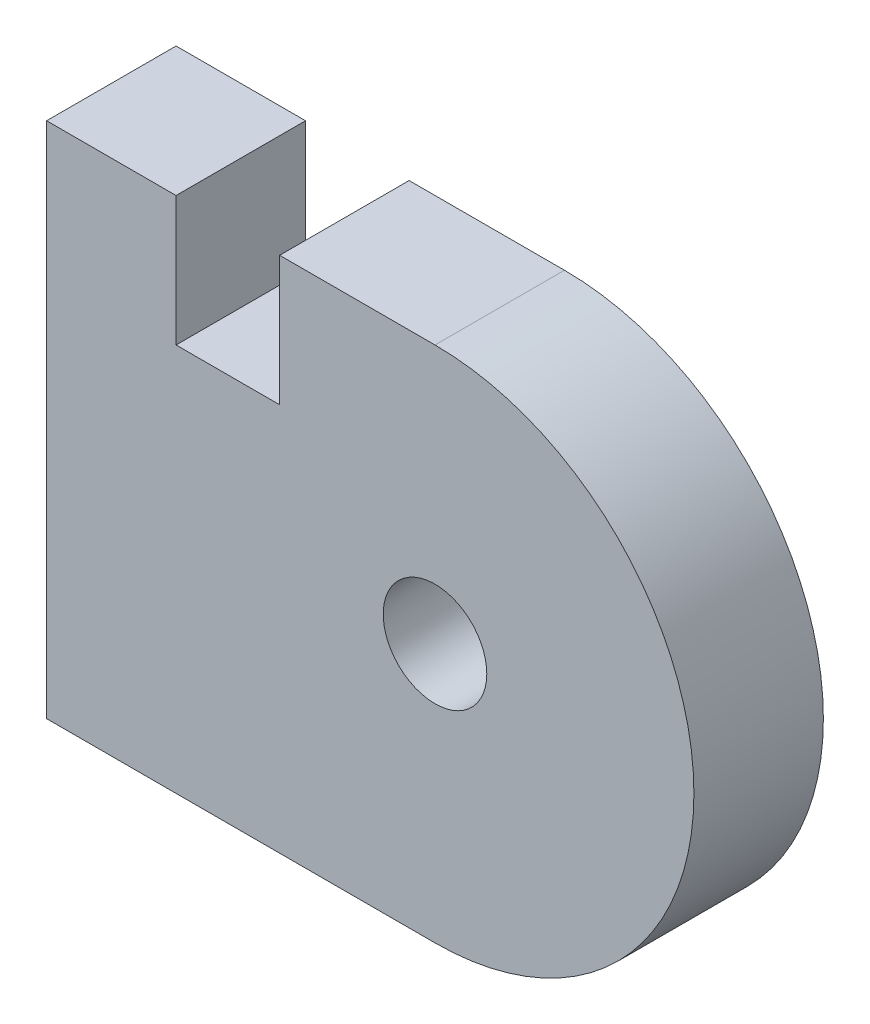
ISO-10303-21;
HEADER;
FILE_DESCRIPTION(('STEP AP214'),'2;1');
FILE_NAME('part.step','',(''),(''),'','','');
FILE_SCHEMA(('AUTOMOTIVE_DESIGN { 1 0 10303 214 1 1 1 1 }'));
ENDSEC;
DATA;
#1=APPLICATION_CONTEXT('core data for automotive mechanical design processes');
#2=APPLICATION_PROTOCOL_DEFINITION('international standard','automotive_design',2000,#1);
#3=PRODUCT_CONTEXT('',#1,'mechanical');
#4=PRODUCT('Part','Part','',(#3));
#5=PRODUCT_RELATED_PRODUCT_CATEGORY('part','',(#4));
#6=PRODUCT_DEFINITION_FORMATION('','',#4);
#7=PRODUCT_DEFINITION_CONTEXT('part definition',#1,'design');
#8=PRODUCT_DEFINITION('design','',#6,#7);
#9=PRODUCT_DEFINITION_SHAPE('','',#8);
#10=(LENGTH_UNIT() NAMED_UNIT(*) SI_UNIT(.MILLI.,.METRE.));
#11=(NAMED_UNIT(*) PLANE_ANGLE_UNIT() SI_UNIT($,.RADIAN.));
#12=(NAMED_UNIT(*) SI_UNIT($,.STERADIAN.) SOLID_ANGLE_UNIT());
#13=UNCERTAINTY_MEASURE_WITH_UNIT(LENGTH_MEASURE(1.E-05),#10,'distance_accuracy_value','');
#14=(GEOMETRIC_REPRESENTATION_CONTEXT(3) GLOBAL_UNCERTAINTY_ASSIGNED_CONTEXT((#13)) GLOBAL_UNIT_ASSIGNED_CONTEXT((#10,
#11,#12)) REPRESENTATION_CONTEXT('',''));
#15=CARTESIAN_POINT('',(0.,0.,0.));
#16=DIRECTION('',(0.,0.,1.));
#17=DIRECTION('',(1.,0.,0.));
#18=AXIS2_PLACEMENT_3D('',#15,#16,#17);
#19=CARTESIAN_POINT('',(2.5,0.,5.));
#20=DIRECTION('',(0.,0.,1.));
#21=DIRECTION('',(1.,0.,0.));
#22=AXIS2_PLACEMENT_3D('',#19,#20,#21);
#23=PLANE('',#22);
#24=CARTESIAN_POINT('',(2.5,0.,5.));
#25=DIRECTION('',(0.,0.,1.));
#26=DIRECTION('',(1.,0.,0.));
#27=AXIS2_PLACEMENT_3D('',#24,#25,#26);
#28=CIRCLE('',#27,10.);
#29=CARTESIAN_POINT('',(2.50000000000011,-10.,5.));
#30=VERTEX_POINT('',#29);
#31=CARTESIAN_POINT('',(2.5,10.,5.));
#32=VERTEX_POINT('',#31);
#33=EDGE_CURVE('E144',#30,#32,#28,.T.);
#34=ORIENTED_EDGE('',*,*,#33,.T.);
#35=DIRECTION('',(-1.,0.,0.));
#36=VECTOR('',#35,1.);
#37=CARTESIAN_POINT('',(-3.5,10.,5.));
#38=LINE('',#37,#36);
#39=CARTESIAN_POINT('',(-3.5,10.,5.));
#40=VERTEX_POINT('',#39);
#41=EDGE_CURVE('E91',#32,#40,#38,.T.);
#42=ORIENTED_EDGE('',*,*,#41,.T.);
#43=DIRECTION('',(0.,-1.,0.));
#44=VECTOR('',#43,1.);
#45=CARTESIAN_POINT('',(-3.5,10.,5.));
#46=LINE('',#45,#44);
#47=CARTESIAN_POINT('',(-3.5,5.,5.));
#48=VERTEX_POINT('',#47);
#49=EDGE_CURVE('E159',#40,#48,#46,.T.);
#50=ORIENTED_EDGE('',*,*,#49,.T.);
#51=DIRECTION('',(-1.,0.,0.));
#52=VECTOR('',#51,1.);
#53=CARTESIAN_POINT('',(-3.5,5.,5.));
#54=LINE('',#53,#52);
#55=CARTESIAN_POINT('',(-7.5,5.,5.));
#56=VERTEX_POINT('',#55);
#57=EDGE_CURVE('E172',#48,#56,#54,.T.);
#58=ORIENTED_EDGE('',*,*,#57,.T.);
#59=DIRECTION('',(0.,1.,0.));
#60=VECTOR('',#59,1.);
#61=CARTESIAN_POINT('',(-7.5,5.,5.));
#62=LINE('',#61,#60);
#63=CARTESIAN_POINT('',(-7.5,10.,5.));
#64=VERTEX_POINT('',#63);
#65=EDGE_CURVE('E110',#56,#64,#62,.T.);
#66=ORIENTED_EDGE('',*,*,#65,.T.);
#67=DIRECTION('',(-1.,0.,0.));
#68=VECTOR('',#67,1.);
#69=CARTESIAN_POINT('',(-7.5,10.,5.));
#70=LINE('',#69,#68);
#71=CARTESIAN_POINT('',(-12.5,10.,5.));
#72=VERTEX_POINT('',#71);
#73=EDGE_CURVE('E104',#64,#72,#70,.T.);
#74=ORIENTED_EDGE('',*,*,#73,.T.);
#75=DIRECTION('',(0.,-1.,0.));
#76=VECTOR('',#75,1.);
#77=CARTESIAN_POINT('',(-12.5,5.,5.));
#78=LINE('',#77,#76);
#79=CARTESIAN_POINT('',(-12.5,-10.,5.));
#80=VERTEX_POINT('',#79);
#81=EDGE_CURVE('E108',#72,#80,#78,.T.);
#82=ORIENTED_EDGE('',*,*,#81,.T.);
#83=DIRECTION('',(1.,0.,0.));
#84=VECTOR('',#83,1.);
#85=CARTESIAN_POINT('',(-12.5,-10.,5.));
#86=LINE('',#85,#84);
#87=EDGE_CURVE('E49',#80,#30,#86,.T.);
#88=ORIENTED_EDGE('',*,*,#87,.T.);
#89=EDGE_LOOP('',(#34,#42,#50,#58,#66,#74,#82,#88));
#90=FACE_BOUND('',#89,.T.);
#91=CARTESIAN_POINT('',(2.5,0.,5.));
#92=DIRECTION('',(0.,0.,1.));
#93=DIRECTION('',(1.,0.,0.));
#94=AXIS2_PLACEMENT_3D('',#91,#92,#93);
#95=CIRCLE('',#94,2.);
#96=CARTESIAN_POINT('',(4.5,0.,5.));
#97=VERTEX_POINT('',#96);
#98=EDGE_CURVE('E133',#97,#97,#95,.T.);
#99=ORIENTED_EDGE('',*,*,#98,.F.);
#100=EDGE_LOOP('',(#99));
#101=FACE_BOUND('',#100,.T.);
#102=ADVANCED_FACE('F32',(#90,#101),#23,.T.);
#103=CARTESIAN_POINT('',(2.5,0.,0.));
#104=DIRECTION('',(0.,0.,1.));
#105=DIRECTION('',(1.,0.,0.));
#106=AXIS2_PLACEMENT_3D('',#103,#104,#105);
#107=PLANE('',#106);
#108=CARTESIAN_POINT('',(2.5,0.,0.));
#109=DIRECTION('',(0.,0.,1.));
#110=DIRECTION('',(1.,0.,0.));
#111=AXIS2_PLACEMENT_3D('',#108,#109,#110);
#112=CIRCLE('',#111,10.);
#113=CARTESIAN_POINT('',(2.50000000000011,-10.,0.));
#114=VERTEX_POINT('',#113);
#115=CARTESIAN_POINT('',(2.5,10.,0.));
#116=VERTEX_POINT('',#115);
#117=EDGE_CURVE('E129',#114,#116,#112,.T.);
#118=ORIENTED_EDGE('',*,*,#117,.F.);
#119=DIRECTION('',(1.,0.,0.));
#120=VECTOR('',#119,1.);
#121=CARTESIAN_POINT('',(-12.5,-10.,0.));
#122=LINE('',#121,#120);
#123=CARTESIAN_POINT('',(-12.5,-10.,0.));
#124=VERTEX_POINT('',#123);
#125=EDGE_CURVE('E83',#124,#114,#122,.T.);
#126=ORIENTED_EDGE('',*,*,#125,.F.);
#127=DIRECTION('',(0.,-1.,0.));
#128=VECTOR('',#127,1.);
#129=CARTESIAN_POINT('',(-12.5,5.,0.));
#130=LINE('',#129,#128);
#131=CARTESIAN_POINT('',(-12.5,10.,0.));
#132=VERTEX_POINT('',#131);
#133=EDGE_CURVE('E77',#132,#124,#130,.T.);
#134=ORIENTED_EDGE('',*,*,#133,.F.);
#135=DIRECTION('',(-1.,0.,0.));
#136=VECTOR('',#135,1.);
#137=CARTESIAN_POINT('',(-7.5,10.,0.));
#138=LINE('',#137,#136);
#139=CARTESIAN_POINT('',(-7.5,10.,0.));
#140=VERTEX_POINT('',#139);
#141=EDGE_CURVE('E119',#140,#132,#138,.T.);
#142=ORIENTED_EDGE('',*,*,#141,.F.);
#143=DIRECTION('',(0.,1.,0.));
#144=VECTOR('',#143,1.);
#145=CARTESIAN_POINT('',(-7.5,5.,0.));
#146=LINE('',#145,#144);
#147=CARTESIAN_POINT('',(-7.5,5.,0.));
#148=VERTEX_POINT('',#147);
#149=EDGE_CURVE('E139',#148,#140,#146,.T.);
#150=ORIENTED_EDGE('',*,*,#149,.F.);
#151=DIRECTION('',(-1.,0.,0.));
#152=VECTOR('',#151,1.);
#153=CARTESIAN_POINT('',(-3.5,5.,0.));
#154=LINE('',#153,#152);
#155=CARTESIAN_POINT('',(-3.5,5.,0.));
#156=VERTEX_POINT('',#155);
#157=EDGE_CURVE('E137',#156,#148,#154,.T.);
#158=ORIENTED_EDGE('',*,*,#157,.F.);
#159=DIRECTION('',(0.,-1.,0.));
#160=VECTOR('',#159,1.);
#161=CARTESIAN_POINT('',(-3.5,10.,0.));
#162=LINE('',#161,#160);
#163=CARTESIAN_POINT('',(-3.5,10.,0.));
#164=VERTEX_POINT('',#163);
#165=EDGE_CURVE('E135',#164,#156,#162,.T.);
#166=ORIENTED_EDGE('',*,*,#165,.F.);
#167=DIRECTION('',(-1.,0.,0.));
#168=VECTOR('',#167,1.);
#169=CARTESIAN_POINT('',(-3.5,10.,0.));
#170=LINE('',#169,#168);
#171=EDGE_CURVE('E132',#116,#164,#170,.T.);
#172=ORIENTED_EDGE('',*,*,#171,.F.);
#173=EDGE_LOOP('',(#118,#126,#134,#142,#150,#158,#166,#172));
#174=FACE_BOUND('',#173,.T.);
#175=CARTESIAN_POINT('',(2.5,0.,0.));
#176=DIRECTION('',(0.,0.,1.));
#177=DIRECTION('',(1.,0.,0.));
#178=AXIS2_PLACEMENT_3D('',#175,#176,#177);
#179=CIRCLE('',#178,2.);
#180=CARTESIAN_POINT('',(4.5,0.,0.));
#181=VERTEX_POINT('',#180);
#182=EDGE_CURVE('E178',#181,#181,#179,.T.);
#183=ORIENTED_EDGE('',*,*,#182,.T.);
#184=EDGE_LOOP('',(#183));
#185=FACE_BOUND('',#184,.T.);
#186=ADVANCED_FACE('F163',(#174,#185),#107,.F.);
#187=CARTESIAN_POINT('',(2.5,0.,5.));
#188=DIRECTION('',(0.,0.,-1.));
#189=DIRECTION('',(-1.,0.,0.));
#190=AXIS2_PLACEMENT_3D('',#187,#188,#189);
#191=CYLINDRICAL_SURFACE('',#190,10.);
#192=ORIENTED_EDGE('',*,*,#117,.T.);
#193=DIRECTION('',(0.,0.,-1.));
#194=VECTOR('',#193,1.);
#195=CARTESIAN_POINT('',(2.5,10.,5.));
#196=LINE('',#195,#194);
#197=EDGE_CURVE('E11',#32,#116,#196,.T.);
#198=ORIENTED_EDGE('',*,*,#197,.F.);
#199=ORIENTED_EDGE('',*,*,#33,.F.);
#200=DIRECTION('',(0.,0.,-1.));
#201=VECTOR('',#200,1.);
#202=CARTESIAN_POINT('',(2.50000000000011,-10.,5.));
#203=LINE('',#202,#201);
#204=EDGE_CURVE('E125',#30,#114,#203,.T.);
#205=ORIENTED_EDGE('',*,*,#204,.T.);
#206=EDGE_LOOP('',(#192,#198,#199,#205));
#207=FACE_BOUND('',#206,.T.);
#208=ADVANCED_FACE('F34',(#207),#191,.T.);
#209=CARTESIAN_POINT('',(-3.5,10.,5.));
#210=DIRECTION('',(0.,-1.,0.));
#211=DIRECTION('',(1.,0.,0.));
#212=AXIS2_PLACEMENT_3D('',#209,#210,#211);
#213=PLANE('',#212);
#214=ORIENTED_EDGE('',*,*,#171,.T.);
#215=DIRECTION('',(0.,0.,-1.));
#216=VECTOR('',#215,1.);
#217=CARTESIAN_POINT('',(-3.5,10.,5.));
#218=LINE('',#217,#216);
#219=EDGE_CURVE('E41',#40,#164,#218,.T.);
#220=ORIENTED_EDGE('',*,*,#219,.F.);
#221=ORIENTED_EDGE('',*,*,#41,.F.);
#222=ORIENTED_EDGE('',*,*,#197,.T.);
#223=EDGE_LOOP('',(#214,#220,#221,#222));
#224=FACE_BOUND('',#223,.T.);
#225=ADVANCED_FACE('F206',(#224),#213,.F.);
#226=CARTESIAN_POINT('',(-3.5,10.,5.));
#227=DIRECTION('',(1.,0.,0.));
#228=DIRECTION('',(0.,0.,-1.));
#229=AXIS2_PLACEMENT_3D('',#226,#227,#228);
#230=PLANE('',#229);
#231=ORIENTED_EDGE('',*,*,#165,.T.);
#232=DIRECTION('',(0.,0.,-1.));
#233=VECTOR('',#232,1.);
#234=CARTESIAN_POINT('',(-3.5,5.,5.));
#235=LINE('',#234,#233);
#236=EDGE_CURVE('E151',#48,#156,#235,.T.);
#237=ORIENTED_EDGE('',*,*,#236,.F.);
#238=ORIENTED_EDGE('',*,*,#49,.F.);
#239=ORIENTED_EDGE('',*,*,#219,.T.);
#240=EDGE_LOOP('',(#231,#237,#238,#239));
#241=FACE_BOUND('',#240,.T.);
#242=ADVANCED_FACE('F157',(#241),#230,.F.);
#243=CARTESIAN_POINT('',(-3.5,5.,5.));
#244=DIRECTION('',(0.,-1.,0.));
#245=DIRECTION('',(1.,0.,0.));
#246=AXIS2_PLACEMENT_3D('',#243,#244,#245);
#247=PLANE('',#246);
#248=ORIENTED_EDGE('',*,*,#157,.T.);
#249=DIRECTION('',(0.,0.,-1.));
#250=VECTOR('',#249,1.);
#251=CARTESIAN_POINT('',(-7.5,5.,5.));
#252=LINE('',#251,#250);
#253=EDGE_CURVE('E148',#56,#148,#252,.T.);
#254=ORIENTED_EDGE('',*,*,#253,.F.);
#255=ORIENTED_EDGE('',*,*,#57,.F.);
#256=ORIENTED_EDGE('',*,*,#236,.T.);
#257=EDGE_LOOP('',(#248,#254,#255,#256));
#258=FACE_BOUND('',#257,.T.);
#259=ADVANCED_FACE('F168',(#258),#247,.F.);
#260=CARTESIAN_POINT('',(-7.5,5.,5.));
#261=DIRECTION('',(-1.,0.,0.));
#262=DIRECTION('',(0.,0.,1.));
#263=AXIS2_PLACEMENT_3D('',#260,#261,#262);
#264=PLANE('',#263);
#265=ORIENTED_EDGE('',*,*,#149,.T.);
#266=DIRECTION('',(0.,0.,-1.));
#267=VECTOR('',#266,1.);
#268=CARTESIAN_POINT('',(-7.5,10.,5.));
#269=LINE('',#268,#267);
#270=EDGE_CURVE('E120',#64,#140,#269,.T.);
#271=ORIENTED_EDGE('',*,*,#270,.F.);
#272=ORIENTED_EDGE('',*,*,#65,.F.);
#273=ORIENTED_EDGE('',*,*,#253,.T.);
#274=EDGE_LOOP('',(#265,#271,#272,#273));
#275=FACE_BOUND('',#274,.T.);
#276=ADVANCED_FACE('F171',(#275),#264,.F.);
#277=CARTESIAN_POINT('',(-7.5,10.,5.));
#278=DIRECTION('',(0.,-1.,0.));
#279=DIRECTION('',(0.,0.,-1.));
#280=AXIS2_PLACEMENT_3D('',#277,#278,#279);
#281=PLANE('',#280);
#282=ORIENTED_EDGE('',*,*,#141,.T.);
#283=DIRECTION('',(0.,0.,-1.));
#284=VECTOR('',#283,1.);
#285=CARTESIAN_POINT('',(-12.5,10.,5.));
#286=LINE('',#285,#284);
#287=EDGE_CURVE('E116',#72,#132,#286,.T.);
#288=ORIENTED_EDGE('',*,*,#287,.F.);
#289=ORIENTED_EDGE('',*,*,#73,.F.);
#290=ORIENTED_EDGE('',*,*,#270,.T.);
#291=EDGE_LOOP('',(#282,#288,#289,#290));
#292=FACE_BOUND('',#291,.T.);
#293=ADVANCED_FACE('F117',(#292),#281,.F.);
#294=CARTESIAN_POINT('',(-12.5,5.,5.));
#295=DIRECTION('',(1.,0.,0.));
#296=DIRECTION('',(0.,0.,-1.));
#297=AXIS2_PLACEMENT_3D('',#294,#295,#296);
#298=PLANE('',#297);
#299=ORIENTED_EDGE('',*,*,#133,.T.);
#300=DIRECTION('',(0.,0.,-1.));
#301=VECTOR('',#300,1.);
#302=CARTESIAN_POINT('',(-12.5,-10.,5.));
#303=LINE('',#302,#301);
#304=EDGE_CURVE('E121',#80,#124,#303,.T.);
#305=ORIENTED_EDGE('',*,*,#304,.F.);
#306=ORIENTED_EDGE('',*,*,#81,.F.);
#307=ORIENTED_EDGE('',*,*,#287,.T.);
#308=EDGE_LOOP('',(#299,#305,#306,#307));
#309=FACE_BOUND('',#308,.T.);
#310=ADVANCED_FACE('F123',(#309),#298,.F.);
#311=CARTESIAN_POINT('',(-12.5,-10.,5.));
#312=DIRECTION('',(0.,1.,0.));
#313=DIRECTION('',(0.,0.,1.));
#314=AXIS2_PLACEMENT_3D('',#311,#312,#313);
#315=PLANE('',#314);
#316=ORIENTED_EDGE('',*,*,#125,.T.);
#317=ORIENTED_EDGE('',*,*,#204,.F.);
#318=ORIENTED_EDGE('',*,*,#87,.F.);
#319=ORIENTED_EDGE('',*,*,#304,.T.);
#320=EDGE_LOOP('',(#316,#317,#318,#319));
#321=FACE_BOUND('',#320,.T.);
#322=ADVANCED_FACE('F194',(#321),#315,.F.);
#323=CARTESIAN_POINT('',(2.5,0.,5.));
#324=DIRECTION('',(0.,0.,-1.));
#325=DIRECTION('',(-1.,0.,0.));
#326=AXIS2_PLACEMENT_3D('',#323,#324,#325);
#327=CYLINDRICAL_SURFACE('',#326,2.);
#328=ORIENTED_EDGE('',*,*,#98,.T.);
#329=EDGE_LOOP('',(#328));
#330=FACE_BOUND('',#329,.T.);
#331=ORIENTED_EDGE('',*,*,#182,.F.);
#332=EDGE_LOOP('',(#331));
#333=FACE_BOUND('',#332,.T.);
#334=ADVANCED_FACE('F184',(#330,#333),#327,.F.);
#335=CLOSED_SHELL('',(#102,#186,#208,#225,#242,#259,#276,#293,#310,#322,#334));
#336=MANIFOLD_SOLID_BREP('B2',#335);
#337=ADVANCED_BREP_SHAPE_REPRESENTATION('',(#18,#336),#14);
#338=SHAPE_DEFINITION_REPRESENTATION(#9,#337);
ENDSEC;
END-ISO-10303-21;
